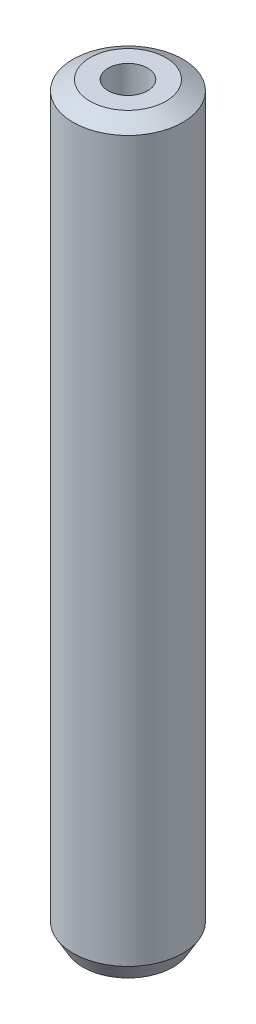
ISO-10303-21;
HEADER;
FILE_DESCRIPTION(('STEP AP214'),'2;1');
FILE_NAME('part.step','',(''),(''),'','','');
FILE_SCHEMA(('AUTOMOTIVE_DESIGN { 1 0 10303 214 1 1 1 1 }'));
ENDSEC;
DATA;
#1=APPLICATION_CONTEXT('core data for automotive mechanical design processes');
#2=APPLICATION_PROTOCOL_DEFINITION('international standard','automotive_design',2000,#1);
#3=PRODUCT_CONTEXT('',#1,'mechanical');
#4=PRODUCT('Part','Part','',(#3));
#5=PRODUCT_RELATED_PRODUCT_CATEGORY('part','',(#4));
#6=PRODUCT_DEFINITION_FORMATION('','',#4);
#7=PRODUCT_DEFINITION_CONTEXT('part definition',#1,'design');
#8=PRODUCT_DEFINITION('design','',#6,#7);
#9=PRODUCT_DEFINITION_SHAPE('','',#8);
#10=(LENGTH_UNIT() NAMED_UNIT(*) SI_UNIT(.MILLI.,.METRE.));
#11=(NAMED_UNIT(*) PLANE_ANGLE_UNIT() SI_UNIT($,.RADIAN.));
#12=(NAMED_UNIT(*) SI_UNIT($,.STERADIAN.) SOLID_ANGLE_UNIT());
#13=UNCERTAINTY_MEASURE_WITH_UNIT(LENGTH_MEASURE(1.E-05),#10,'distance_accuracy_value','');
#14=(GEOMETRIC_REPRESENTATION_CONTEXT(3) GLOBAL_UNCERTAINTY_ASSIGNED_CONTEXT((#13)) GLOBAL_UNIT_ASSIGNED_CONTEXT((#10,
#11,#12)) REPRESENTATION_CONTEXT('',''));
#15=CARTESIAN_POINT('',(0.,0.,0.));
#16=DIRECTION('',(0.,0.,1.));
#17=DIRECTION('',(1.,0.,0.));
#18=AXIS2_PLACEMENT_3D('',#15,#16,#17);
#19=CARTESIAN_POINT('',(0.,136.159849882135,0.));
#20=DIRECTION('',(0.,-1.,0.));
#21=DIRECTION('',(0.,0.,-1.));
#22=AXIS2_PLACEMENT_3D('',#19,#20,#21);
#23=CYLINDRICAL_SURFACE('',#22,10.);
#24=CARTESIAN_POINT('',(0.,134.373254676644,0.));
#25=DIRECTION('',(0.,1.,0.));
#26=DIRECTION('',(0.,0.,1.));
#27=AXIS2_PLACEMENT_3D('',#24,#25,#26);
#28=CIRCLE('',#27,10.);
#29=CARTESIAN_POINT('',(0.,134.373254676644,10.));
#30=VERTEX_POINT('',#29);
#31=EDGE_CURVE('E50',#30,#30,#28,.F.);
#32=ORIENTED_EDGE('',*,*,#31,.T.);
#33=EDGE_LOOP('',(#32));
#34=FACE_BOUND('',#33,.T.);
#35=CARTESIAN_POINT('',(0.,3.09447366846949,0.));
#36=DIRECTION('',(0.,1.,0.));
#37=DIRECTION('',(0.,0.,1.));
#38=AXIS2_PLACEMENT_3D('',#35,#36,#37);
#39=CIRCLE('',#38,10.);
#40=CARTESIAN_POINT('',(0.,3.09447366846949,10.));
#41=VERTEX_POINT('',#40);
#42=EDGE_CURVE('E51',#41,#41,#39,.T.);
#43=ORIENTED_EDGE('',*,*,#42,.T.);
#44=EDGE_LOOP('',(#43));
#45=FACE_BOUND('',#44,.T.);
#46=ADVANCED_FACE('F39',(#34,#45),#23,.T.);
#47=CARTESIAN_POINT('',(0.,136.159849882135,0.));
#48=DIRECTION('',(0.,1.,0.));
#49=DIRECTION('',(0.,0.,1.));
#50=AXIS2_PLACEMENT_3D('',#47,#48,#49);
#51=PLANE('',#50);
#52=CARTESIAN_POINT('',(0.,136.159849882135,0.));
#53=DIRECTION('',(0.,1.,0.));
#54=DIRECTION('',(0.,0.,1.));
#55=AXIS2_PLACEMENT_3D('',#52,#53,#54);
#56=CIRCLE('',#55,6.90552633153052);
#57=CARTESIAN_POINT('',(0.,136.159849882135,6.90552633153052));
#58=VERTEX_POINT('',#57);
#59=EDGE_CURVE('E54',#58,#58,#56,.T.);
#60=ORIENTED_EDGE('',*,*,#59,.T.);
#61=EDGE_LOOP('',(#60));
#62=FACE_BOUND('',#61,.T.);
#63=CARTESIAN_POINT('',(0.,136.159849882135,0.));
#64=DIRECTION('',(0.,1.,0.));
#65=DIRECTION('',(0.,0.,1.));
#66=AXIS2_PLACEMENT_3D('',#63,#64,#65);
#67=CIRCLE('',#66,3.59120173049199);
#68=CARTESIAN_POINT('',(0.,136.159849882135,3.59120173049199));
#69=VERTEX_POINT('',#68);
#70=EDGE_CURVE('E58',#69,#69,#67,.T.);
#71=ORIENTED_EDGE('',*,*,#70,.F.);
#72=EDGE_LOOP('',(#71));
#73=FACE_BOUND('',#72,.T.);
#74=ADVANCED_FACE('F69',(#62,#73),#51,.T.);
#75=CARTESIAN_POINT('',(0.,0.,0.));
#76=DIRECTION('',(0.,1.,0.));
#77=DIRECTION('',(0.,0.,1.));
#78=AXIS2_PLACEMENT_3D('',#75,#76,#77);
#79=PLANE('',#78);
#80=CARTESIAN_POINT('',(0.,0.,0.));
#81=DIRECTION('',(0.,1.,0.));
#82=DIRECTION('',(0.,0.,1.));
#83=AXIS2_PLACEMENT_3D('',#80,#81,#82);
#84=CIRCLE('',#83,8.21340479450892);
#85=CARTESIAN_POINT('',(0.,0.,8.21340479450892));
#86=VERTEX_POINT('',#85);
#87=EDGE_CURVE('E10',#86,#86,#84,.F.);
#88=ORIENTED_EDGE('',*,*,#87,.T.);
#89=EDGE_LOOP('',(#88));
#90=FACE_BOUND('',#89,.T.);
#91=CARTESIAN_POINT('',(0.,0.,0.));
#92=DIRECTION('',(0.,1.,0.));
#93=DIRECTION('',(0.,0.,1.));
#94=AXIS2_PLACEMENT_3D('',#91,#92,#93);
#95=CIRCLE('',#94,3.59120173049199);
#96=CARTESIAN_POINT('',(0.,0.,3.59120173049199));
#97=VERTEX_POINT('',#96);
#98=EDGE_CURVE('E63',#97,#97,#95,.T.);
#99=ORIENTED_EDGE('',*,*,#98,.T.);
#100=EDGE_LOOP('',(#99));
#101=FACE_BOUND('',#100,.T.);
#102=ADVANCED_FACE('F75',(#90,#101),#79,.F.);
#103=CARTESIAN_POINT('',(0.,136.159849882135,0.));
#104=DIRECTION('',(0.,-1.,0.));
#105=DIRECTION('',(0.,0.,-1.));
#106=AXIS2_PLACEMENT_3D('',#103,#104,#105);
#107=CYLINDRICAL_SURFACE('',#106,3.59120173049199);
#108=ORIENTED_EDGE('',*,*,#70,.T.);
#109=EDGE_LOOP('',(#108));
#110=FACE_BOUND('',#109,.T.);
#111=ORIENTED_EDGE('',*,*,#98,.F.);
#112=EDGE_LOOP('',(#111));
#113=FACE_BOUND('',#112,.T.);
#114=ADVANCED_FACE('F70',(#110,#113),#107,.F.);
#115=CARTESIAN_POINT('',(0.,136.159849882135,0.));
#116=DIRECTION('',(0.,-1.,0.));
#117=DIRECTION('',(0.,0.,-1.));
#118=AXIS2_PLACEMENT_3D('',#115,#116,#117);
#119=CONICAL_SURFACE('',#118,6.90552633153052,1.0471975511966);
#120=ORIENTED_EDGE('',*,*,#31,.F.);
#121=EDGE_LOOP('',(#120));
#122=FACE_BOUND('',#121,.T.);
#123=ORIENTED_EDGE('',*,*,#59,.F.);
#124=EDGE_LOOP('',(#123));
#125=FACE_BOUND('',#124,.T.);
#126=ADVANCED_FACE('F81',(#122,#125),#119,.T.);
#127=CARTESIAN_POINT('',(0.,3.09447366846949,0.));
#128=DIRECTION('',(0.,1.,0.));
#129=DIRECTION('',(0.,0.,1.));
#130=AXIS2_PLACEMENT_3D('',#127,#128,#129);
#131=CONICAL_SURFACE('',#130,10.,0.523598775598302);
#132=ORIENTED_EDGE('',*,*,#87,.F.);
#133=EDGE_LOOP('',(#132));
#134=FACE_BOUND('',#133,.T.);
#135=ORIENTED_EDGE('',*,*,#42,.F.);
#136=EDGE_LOOP('',(#135));
#137=FACE_BOUND('',#136,.T.);
#138=ADVANCED_FACE('F45',(#134,#137),#131,.T.);
#139=CLOSED_SHELL('',(#46,#74,#102,#114,#126,#138));
#140=MANIFOLD_SOLID_BREP('B2',#139);
#141=ADVANCED_BREP_SHAPE_REPRESENTATION('',(#18,#140),#14);
#142=SHAPE_DEFINITION_REPRESENTATION(#9,#141);
ENDSEC;
END-ISO-10303-21;
